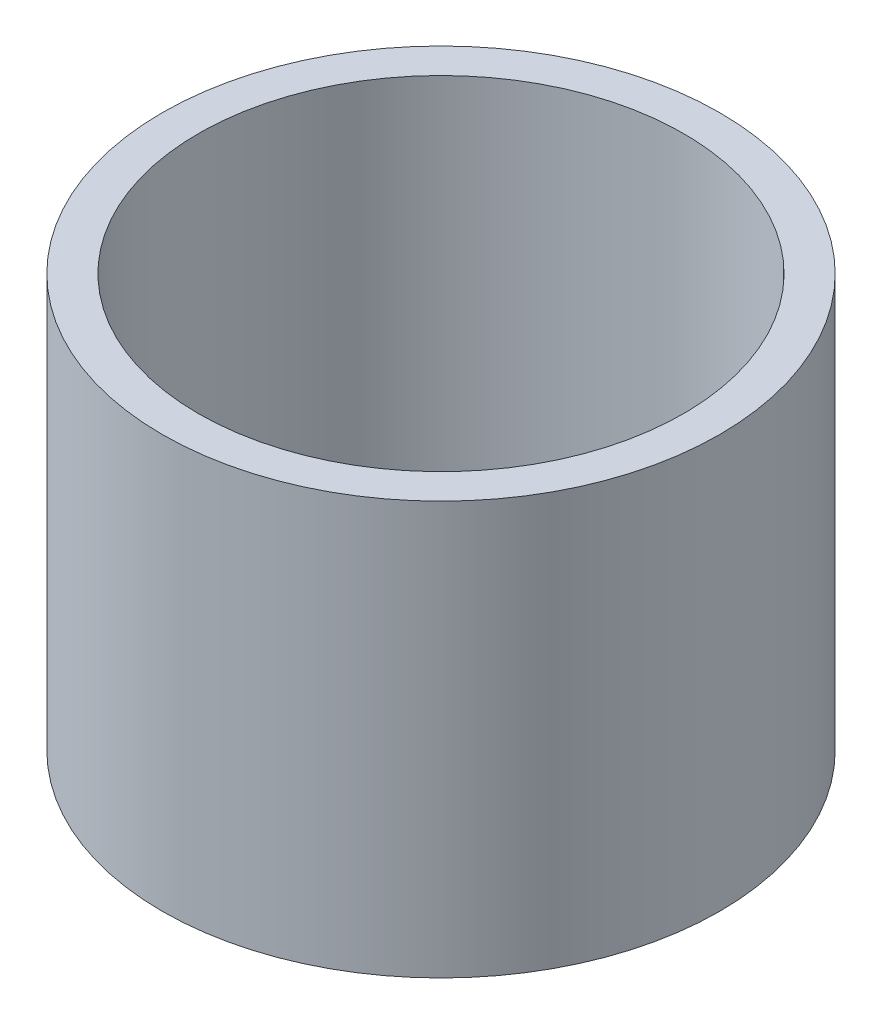
ISO-10303-21;
HEADER;
FILE_DESCRIPTION(('STEP AP214'),'2;1');
FILE_NAME('part.step','',(''),(''),'','','');
FILE_SCHEMA(('AUTOMOTIVE_DESIGN { 1 0 10303 214 1 1 1 1 }'));
ENDSEC;
DATA;
#1=APPLICATION_CONTEXT('core data for automotive mechanical design processes');
#2=APPLICATION_PROTOCOL_DEFINITION('international standard','automotive_design',2000,#1);
#3=PRODUCT_CONTEXT('',#1,'mechanical');
#4=PRODUCT('Part','Part','',(#3));
#5=PRODUCT_RELATED_PRODUCT_CATEGORY('part','',(#4));
#6=PRODUCT_DEFINITION_FORMATION('','',#4);
#7=PRODUCT_DEFINITION_CONTEXT('part definition',#1,'design');
#8=PRODUCT_DEFINITION('design','',#6,#7);
#9=PRODUCT_DEFINITION_SHAPE('','',#8);
#10=(LENGTH_UNIT() NAMED_UNIT(*) SI_UNIT(.MILLI.,.METRE.));
#11=(NAMED_UNIT(*) PLANE_ANGLE_UNIT() SI_UNIT($,.RADIAN.));
#12=(NAMED_UNIT(*) SI_UNIT($,.STERADIAN.) SOLID_ANGLE_UNIT());
#13=UNCERTAINTY_MEASURE_WITH_UNIT(LENGTH_MEASURE(1.E-05),#10,'distance_accuracy_value','');
#14=(GEOMETRIC_REPRESENTATION_CONTEXT(3) GLOBAL_UNCERTAINTY_ASSIGNED_CONTEXT((#13)) GLOBAL_UNIT_ASSIGNED_CONTEXT((#10,
#11,#12)) REPRESENTATION_CONTEXT('',''));
#15=CARTESIAN_POINT('',(0.,0.,0.));
#16=DIRECTION('',(0.,0.,1.));
#17=DIRECTION('',(1.,0.,0.));
#18=AXIS2_PLACEMENT_3D('',#15,#16,#17);
#19=CARTESIAN_POINT('',(0.,40.,0.));
#20=DIRECTION('',(0.,1.,0.));
#21=DIRECTION('',(0.,0.,1.));
#22=AXIS2_PLACEMENT_3D('',#19,#20,#21);
#23=PLANE('',#22);
#24=CARTESIAN_POINT('',(0.,40.,0.));
#25=DIRECTION('',(0.,1.,0.));
#26=DIRECTION('',(0.,0.,1.));
#27=AXIS2_PLACEMENT_3D('',#24,#25,#26);
#28=CIRCLE('',#27,27.);
#29=CARTESIAN_POINT('',(0.,40.,27.));
#30=VERTEX_POINT('',#29);
#31=EDGE_CURVE('E10',#30,#30,#28,.T.);
#32=ORIENTED_EDGE('',*,*,#31,.T.);
#33=EDGE_LOOP('',(#32));
#34=FACE_BOUND('',#33,.T.);
#35=CARTESIAN_POINT('',(0.,40.,0.));
#36=DIRECTION('',(0.,1.,0.));
#37=DIRECTION('',(0.,0.,1.));
#38=AXIS2_PLACEMENT_3D('',#35,#36,#37);
#39=CIRCLE('',#38,23.5);
#40=CARTESIAN_POINT('',(0.,40.,23.5));
#41=VERTEX_POINT('',#40);
#42=EDGE_CURVE('E50',#41,#41,#39,.T.);
#43=ORIENTED_EDGE('',*,*,#42,.F.);
#44=EDGE_LOOP('',(#43));
#45=FACE_BOUND('',#44,.T.);
#46=ADVANCED_FACE('F37',(#34,#45),#23,.T.);
#47=CARTESIAN_POINT('',(0.,0.,0.));
#48=DIRECTION('',(0.,1.,0.));
#49=DIRECTION('',(0.,0.,1.));
#50=AXIS2_PLACEMENT_3D('',#47,#48,#49);
#51=PLANE('',#50);
#52=CARTESIAN_POINT('',(0.,0.,0.));
#53=DIRECTION('',(0.,1.,0.));
#54=DIRECTION('',(0.,0.,1.));
#55=AXIS2_PLACEMENT_3D('',#52,#53,#54);
#56=CIRCLE('',#55,27.);
#57=CARTESIAN_POINT('',(0.,0.,27.));
#58=VERTEX_POINT('',#57);
#59=EDGE_CURVE('E41',#58,#58,#56,.T.);
#60=ORIENTED_EDGE('',*,*,#59,.F.);
#61=EDGE_LOOP('',(#60));
#62=FACE_BOUND('',#61,.T.);
#63=CARTESIAN_POINT('',(0.,0.,0.));
#64=DIRECTION('',(0.,1.,0.));
#65=DIRECTION('',(0.,0.,1.));
#66=AXIS2_PLACEMENT_3D('',#63,#64,#65);
#67=CIRCLE('',#66,23.5);
#68=CARTESIAN_POINT('',(0.,0.,23.5));
#69=VERTEX_POINT('',#68);
#70=EDGE_CURVE('E52',#69,#69,#67,.T.);
#71=ORIENTED_EDGE('',*,*,#70,.T.);
#72=EDGE_LOOP('',(#71));
#73=FACE_BOUND('',#72,.T.);
#74=ADVANCED_FACE('F64',(#62,#73),#51,.F.);
#75=CARTESIAN_POINT('',(0.,40.,0.));
#76=DIRECTION('',(0.,-1.,0.));
#77=DIRECTION('',(0.,0.,-1.));
#78=AXIS2_PLACEMENT_3D('',#75,#76,#77);
#79=CYLINDRICAL_SURFACE('',#78,27.);
#80=ORIENTED_EDGE('',*,*,#31,.F.);
#81=EDGE_LOOP('',(#80));
#82=FACE_BOUND('',#81,.T.);
#83=ORIENTED_EDGE('',*,*,#59,.T.);
#84=EDGE_LOOP('',(#83));
#85=FACE_BOUND('',#84,.T.);
#86=ADVANCED_FACE('F39',(#82,#85),#79,.T.);
#87=CARTESIAN_POINT('',(0.,40.,0.));
#88=DIRECTION('',(0.,-1.,0.));
#89=DIRECTION('',(0.,0.,-1.));
#90=AXIS2_PLACEMENT_3D('',#87,#88,#89);
#91=CYLINDRICAL_SURFACE('',#90,23.5);
#92=ORIENTED_EDGE('',*,*,#42,.T.);
#93=EDGE_LOOP('',(#92));
#94=FACE_BOUND('',#93,.T.);
#95=ORIENTED_EDGE('',*,*,#70,.F.);
#96=EDGE_LOOP('',(#95));
#97=FACE_BOUND('',#96,.T.);
#98=ADVANCED_FACE('F60',(#94,#97),#91,.F.);
#99=CLOSED_SHELL('',(#46,#74,#86,#98));
#100=MANIFOLD_SOLID_BREP('B2',#99);
#101=ADVANCED_BREP_SHAPE_REPRESENTATION('',(#18,#100),#14);
#102=SHAPE_DEFINITION_REPRESENTATION(#9,#101);
ENDSEC;
END-ISO-10303-21;
